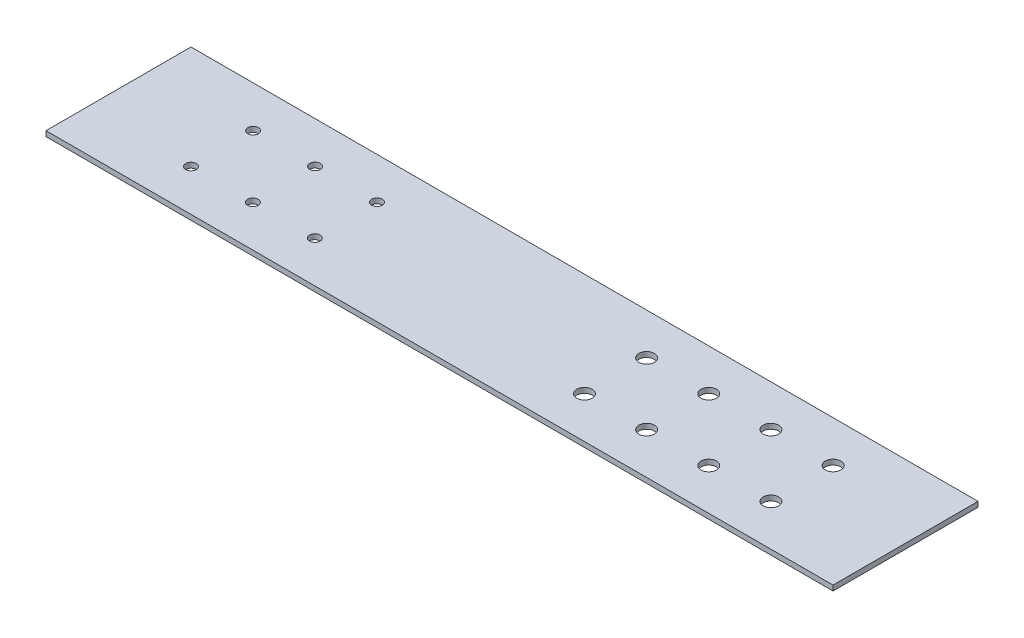
ISO-10303-21;
HEADER;
FILE_DESCRIPTION(('STEP AP214'),'2;1');
FILE_NAME('part.step','',(''),(''),'','','');
FILE_SCHEMA(('AUTOMOTIVE_DESIGN { 1 0 10303 214 1 1 1 1 }'));
ENDSEC;
DATA;
#1=APPLICATION_CONTEXT('core data for automotive mechanical design processes');
#2=APPLICATION_PROTOCOL_DEFINITION('international standard','automotive_design',2000,#1);
#3=PRODUCT_CONTEXT('',#1,'mechanical');
#4=PRODUCT('Part','Part','',(#3));
#5=PRODUCT_RELATED_PRODUCT_CATEGORY('part','',(#4));
#6=PRODUCT_DEFINITION_FORMATION('','',#4);
#7=PRODUCT_DEFINITION_CONTEXT('part definition',#1,'design');
#8=PRODUCT_DEFINITION('design','',#6,#7);
#9=PRODUCT_DEFINITION_SHAPE('','',#8);
#10=(LENGTH_UNIT() NAMED_UNIT(*) SI_UNIT(.MILLI.,.METRE.));
#11=(NAMED_UNIT(*) PLANE_ANGLE_UNIT() SI_UNIT($,.RADIAN.));
#12=(NAMED_UNIT(*) SI_UNIT($,.STERADIAN.) SOLID_ANGLE_UNIT());
#13=UNCERTAINTY_MEASURE_WITH_UNIT(LENGTH_MEASURE(1.E-05),#10,'distance_accuracy_value','');
#14=(GEOMETRIC_REPRESENTATION_CONTEXT(3) GLOBAL_UNCERTAINTY_ASSIGNED_CONTEXT((#13)) GLOBAL_UNIT_ASSIGNED_CONTEXT((#10,
#11,#12)) REPRESENTATION_CONTEXT('',''));
#15=CARTESIAN_POINT('',(0.,0.,0.));
#16=DIRECTION('',(0.,0.,1.));
#17=DIRECTION('',(1.,0.,0.));
#18=AXIS2_PLACEMENT_3D('',#15,#16,#17);
#19=CARTESIAN_POINT('',(-241.3,3.175,-44.45));
#20=DIRECTION('',(1.,0.,0.));
#21=DIRECTION('',(0.,0.,-1.));
#22=AXIS2_PLACEMENT_3D('',#19,#20,#21);
#23=PLANE('',#22);
#24=DIRECTION('',(0.,0.,1.));
#25=VECTOR('',#24,1.);
#26=CARTESIAN_POINT('',(-241.3,0.,-44.45));
#27=LINE('',#26,#25);
#28=CARTESIAN_POINT('',(-241.3,0.,-44.45));
#29=VERTEX_POINT('',#28);
#30=CARTESIAN_POINT('',(-241.3,0.,44.45));
#31=VERTEX_POINT('',#30);
#32=EDGE_CURVE('E107',#29,#31,#27,.T.);
#33=ORIENTED_EDGE('',*,*,#32,.T.);
#34=DIRECTION('',(0.,-1.,0.));
#35=VECTOR('',#34,1.);
#36=CARTESIAN_POINT('',(-241.3,3.175,44.45));
#37=LINE('',#36,#35);
#38=CARTESIAN_POINT('',(-241.3,3.175,44.45));
#39=VERTEX_POINT('',#38);
#40=EDGE_CURVE('E11',#39,#31,#37,.T.);
#41=ORIENTED_EDGE('',*,*,#40,.F.);
#42=DIRECTION('',(0.,0.,1.));
#43=VECTOR('',#42,1.);
#44=CARTESIAN_POINT('',(-241.3,3.175,-44.45));
#45=LINE('',#44,#43);
#46=CARTESIAN_POINT('',(-241.3,3.175,-44.45));
#47=VERTEX_POINT('',#46);
#48=EDGE_CURVE('E91',#47,#39,#45,.T.);
#49=ORIENTED_EDGE('',*,*,#48,.F.);
#50=DIRECTION('',(0.,-1.,0.));
#51=VECTOR('',#50,1.);
#52=CARTESIAN_POINT('',(-241.3,3.175,-44.45));
#53=LINE('',#52,#51);
#54=EDGE_CURVE('E103',#47,#29,#53,.T.);
#55=ORIENTED_EDGE('',*,*,#54,.T.);
#56=EDGE_LOOP('',(#33,#41,#49,#55));
#57=FACE_BOUND('',#56,.T.);
#58=ADVANCED_FACE('F39',(#57),#23,.F.);
#59=CARTESIAN_POINT('',(241.3,3.175,44.45));
#60=DIRECTION('',(0.,0.,-1.));
#61=DIRECTION('',(-1.,0.,0.));
#62=AXIS2_PLACEMENT_3D('',#59,#60,#61);
#63=PLANE('',#62);
#64=DIRECTION('',(1.,0.,0.));
#65=VECTOR('',#64,1.);
#66=CARTESIAN_POINT('',(241.3,0.,44.45));
#67=LINE('',#66,#65);
#68=CARTESIAN_POINT('',(241.3,0.,44.45));
#69=VERTEX_POINT('',#68);
#70=EDGE_CURVE('E96',#31,#69,#67,.T.);
#71=ORIENTED_EDGE('',*,*,#70,.T.);
#72=DIRECTION('',(0.,-1.,0.));
#73=VECTOR('',#72,1.);
#74=CARTESIAN_POINT('',(241.3,3.175,44.45));
#75=LINE('',#74,#73);
#76=CARTESIAN_POINT('',(241.3,3.175,44.45));
#77=VERTEX_POINT('',#76);
#78=EDGE_CURVE('E48',#77,#69,#75,.T.);
#79=ORIENTED_EDGE('',*,*,#78,.F.);
#80=DIRECTION('',(1.,0.,0.));
#81=VECTOR('',#80,1.);
#82=CARTESIAN_POINT('',(241.3,3.175,44.45));
#83=LINE('',#82,#81);
#84=EDGE_CURVE('E86',#39,#77,#83,.T.);
#85=ORIENTED_EDGE('',*,*,#84,.F.);
#86=ORIENTED_EDGE('',*,*,#40,.T.);
#87=EDGE_LOOP('',(#71,#79,#85,#86));
#88=FACE_BOUND('',#87,.T.);
#89=ADVANCED_FACE('F95',(#88),#63,.F.);
#90=CARTESIAN_POINT('',(241.3,3.175,-44.45));
#91=DIRECTION('',(-1.,0.,0.));
#92=DIRECTION('',(0.,0.,1.));
#93=AXIS2_PLACEMENT_3D('',#90,#91,#92);
#94=PLANE('',#93);
#95=DIRECTION('',(0.,0.,-1.));
#96=VECTOR('',#95,1.);
#97=CARTESIAN_POINT('',(241.3,0.,-44.45));
#98=LINE('',#97,#96);
#99=CARTESIAN_POINT('',(241.3,0.,-44.45));
#100=VERTEX_POINT('',#99);
#101=EDGE_CURVE('E73',#69,#100,#98,.T.);
#102=ORIENTED_EDGE('',*,*,#101,.T.);
#103=DIRECTION('',(0.,-1.,0.));
#104=VECTOR('',#103,1.);
#105=CARTESIAN_POINT('',(241.3,3.175,-44.45));
#106=LINE('',#105,#104);
#107=CARTESIAN_POINT('',(241.3,3.175,-44.45));
#108=VERTEX_POINT('',#107);
#109=EDGE_CURVE('E98',#108,#100,#106,.T.);
#110=ORIENTED_EDGE('',*,*,#109,.F.);
#111=DIRECTION('',(0.,0.,-1.));
#112=VECTOR('',#111,1.);
#113=CARTESIAN_POINT('',(241.3,3.175,-44.45));
#114=LINE('',#113,#112);
#115=EDGE_CURVE('E89',#77,#108,#114,.T.);
#116=ORIENTED_EDGE('',*,*,#115,.F.);
#117=ORIENTED_EDGE('',*,*,#78,.T.);
#118=EDGE_LOOP('',(#102,#110,#116,#117));
#119=FACE_BOUND('',#118,.T.);
#120=ADVANCED_FACE('F99',(#119),#94,.F.);
#121=CARTESIAN_POINT('',(241.3,3.175,-44.45));
#122=DIRECTION('',(0.,0.,1.));
#123=DIRECTION('',(1.,0.,0.));
#124=AXIS2_PLACEMENT_3D('',#121,#122,#123);
#125=PLANE('',#124);
#126=DIRECTION('',(-1.,0.,0.));
#127=VECTOR('',#126,1.);
#128=CARTESIAN_POINT('',(241.3,0.,-44.45));
#129=LINE('',#128,#127);
#130=EDGE_CURVE('E79',#100,#29,#129,.T.);
#131=ORIENTED_EDGE('',*,*,#130,.T.);
#132=ORIENTED_EDGE('',*,*,#54,.F.);
#133=DIRECTION('',(-1.,0.,0.));
#134=VECTOR('',#133,1.);
#135=CARTESIAN_POINT('',(241.3,3.175,-44.45));
#136=LINE('',#135,#134);
#137=EDGE_CURVE('E56',#108,#47,#136,.T.);
#138=ORIENTED_EDGE('',*,*,#137,.F.);
#139=ORIENTED_EDGE('',*,*,#109,.T.);
#140=EDGE_LOOP('',(#131,#132,#138,#139));
#141=FACE_BOUND('',#140,.T.);
#142=ADVANCED_FACE('F121',(#141),#125,.F.);
#143=CARTESIAN_POINT('',(0.,3.175,0.));
#144=DIRECTION('',(0.,-1.,0.));
#145=DIRECTION('',(0.,0.,-1.));
#146=AXIS2_PLACEMENT_3D('',#143,#144,#145);
#147=PLANE('',#146);
#148=CARTESIAN_POINT('',(-139.821484560945,3.175,19.0500000000015));
#149=DIRECTION('',(0.,1.,0.));
#150=DIRECTION('',(0.,0.,1.));
#151=AXIS2_PLACEMENT_3D('',#148,#149,#150);
#152=CIRCLE('',#151,3.25000000000001);
#153=CARTESIAN_POINT('',(-139.821484560945,3.175,22.3000000000015));
#154=VERTEX_POINT('',#153);
#155=EDGE_CURVE('E193',#154,#154,#152,.T.);
#156=ORIENTED_EDGE('',*,*,#155,.F.);
#157=EDGE_LOOP('',(#156));
#158=FACE_BOUND('',#157,.T.);
#159=CARTESIAN_POINT('',(-177.8,3.175,19.0500000000017));
#160=DIRECTION('',(0.,1.,0.));
#161=DIRECTION('',(0.,0.,1.));
#162=AXIS2_PLACEMENT_3D('',#159,#160,#161);
#163=CIRCLE('',#162,3.25000000000001);
#164=CARTESIAN_POINT('',(-177.8,3.175,22.3000000000017));
#165=VERTEX_POINT('',#164);
#166=EDGE_CURVE('E185',#165,#165,#163,.T.);
#167=ORIENTED_EDGE('',*,*,#166,.F.);
#168=EDGE_LOOP('',(#167));
#169=FACE_BOUND('',#168,.T.);
#170=CARTESIAN_POINT('',(-139.821484560945,3.175,-19.0499999999972));
#171=DIRECTION('',(0.,1.,0.));
#172=DIRECTION('',(0.,0.,1.));
#173=AXIS2_PLACEMENT_3D('',#170,#171,#172);
#174=CIRCLE('',#173,3.25000000000001);
#175=CARTESIAN_POINT('',(-139.821484560945,3.175,-15.7999999999972));
#176=VERTEX_POINT('',#175);
#177=EDGE_CURVE('E177',#176,#176,#174,.T.);
#178=ORIENTED_EDGE('',*,*,#177,.F.);
#179=EDGE_LOOP('',(#178));
#180=FACE_BOUND('',#179,.T.);
#181=CARTESIAN_POINT('',(-177.8,3.175,-19.0499999999972));
#182=DIRECTION('',(0.,1.,0.));
#183=DIRECTION('',(0.,0.,1.));
#184=AXIS2_PLACEMENT_3D('',#181,#182,#183);
#185=CIRCLE('',#184,3.25000000000001);
#186=CARTESIAN_POINT('',(-177.8,3.175,-15.7999999999972));
#187=VERTEX_POINT('',#186);
#188=EDGE_CURVE('E153',#187,#187,#185,.T.);
#189=ORIENTED_EDGE('',*,*,#188,.F.);
#190=EDGE_LOOP('',(#189));
#191=FACE_BOUND('',#190,.T.);
#192=CARTESIAN_POINT('',(101.600000000001,3.175,19.0500000000025));
#193=DIRECTION('',(0.,1.,0.));
#194=DIRECTION('',(0.,0.,1.));
#195=AXIS2_PLACEMENT_3D('',#192,#193,#194);
#196=CIRCLE('',#195,4.7625);
#197=CARTESIAN_POINT('',(101.600000000001,3.175,23.8125000000025));
#198=VERTEX_POINT('',#197);
#199=EDGE_CURVE('E154',#198,#198,#196,.T.);
#200=ORIENTED_EDGE('',*,*,#199,.F.);
#201=EDGE_LOOP('',(#200));
#202=FACE_BOUND('',#201,.T.);
#203=CARTESIAN_POINT('',(139.700000000001,3.175,19.0500000000023));
#204=DIRECTION('',(0.,1.,0.));
#205=DIRECTION('',(0.,0.,1.));
#206=AXIS2_PLACEMENT_3D('',#203,#204,#205);
#207=CIRCLE('',#206,4.76250000000001);
#208=CARTESIAN_POINT('',(139.700000000001,3.175,23.8125000000023));
#209=VERTEX_POINT('',#208);
#210=EDGE_CURVE('E163',#209,#209,#207,.T.);
#211=ORIENTED_EDGE('',*,*,#210,.F.);
#212=EDGE_LOOP('',(#211));
#213=FACE_BOUND('',#212,.T.);
#214=CARTESIAN_POINT('',(177.800000000001,3.175,19.050000000002));
#215=DIRECTION('',(0.,1.,0.));
#216=DIRECTION('',(0.,0.,1.));
#217=AXIS2_PLACEMENT_3D('',#214,#215,#216);
#218=CIRCLE('',#217,4.76250000000001);
#219=CARTESIAN_POINT('',(177.800000000001,3.175,23.812500000002));
#220=VERTEX_POINT('',#219);
#221=EDGE_CURVE('E136',#220,#220,#218,.T.);
#222=ORIENTED_EDGE('',*,*,#221,.F.);
#223=EDGE_LOOP('',(#222));
#224=FACE_BOUND('',#223,.T.);
#225=CARTESIAN_POINT('',(-101.842969121891,3.175,-19.0499999999972));
#226=DIRECTION('',(0.,1.,0.));
#227=DIRECTION('',(0.,0.,1.));
#228=AXIS2_PLACEMENT_3D('',#225,#226,#227);
#229=CIRCLE('',#228,3.25000000000001);
#230=CARTESIAN_POINT('',(-101.842969121891,3.175,-15.7999999999972));
#231=VERTEX_POINT('',#230);
#232=EDGE_CURVE('E145',#231,#231,#229,.T.);
#233=ORIENTED_EDGE('',*,*,#232,.F.);
#234=EDGE_LOOP('',(#233));
#235=FACE_BOUND('',#234,.T.);
#236=CARTESIAN_POINT('',(63.5000000000001,3.175,-19.0499999999972));
#237=DIRECTION('',(0.,1.,0.));
#238=DIRECTION('',(0.,0.,1.));
#239=AXIS2_PLACEMENT_3D('',#236,#237,#238);
#240=CIRCLE('',#239,4.7625);
#241=CARTESIAN_POINT('',(63.5000000000001,3.175,-14.2874999999972));
#242=VERTEX_POINT('',#241);
#243=EDGE_CURVE('E208',#242,#242,#240,.T.);
#244=ORIENTED_EDGE('',*,*,#243,.F.);
#245=EDGE_LOOP('',(#244));
#246=FACE_BOUND('',#245,.T.);
#247=CARTESIAN_POINT('',(101.6,3.175,-19.0499999999975));
#248=DIRECTION('',(0.,1.,0.));
#249=DIRECTION('',(0.,0.,1.));
#250=AXIS2_PLACEMENT_3D('',#247,#248,#249);
#251=CIRCLE('',#250,4.7625);
#252=CARTESIAN_POINT('',(101.6,3.175,-14.2874999999975));
#253=VERTEX_POINT('',#252);
#254=EDGE_CURVE('E232',#253,#253,#251,.T.);
#255=ORIENTED_EDGE('',*,*,#254,.F.);
#256=EDGE_LOOP('',(#255));
#257=FACE_BOUND('',#256,.T.);
#258=CARTESIAN_POINT('',(139.7,3.175,-19.0499999999977));
#259=DIRECTION('',(0.,1.,0.));
#260=DIRECTION('',(0.,0.,1.));
#261=AXIS2_PLACEMENT_3D('',#258,#259,#260);
#262=CIRCLE('',#261,4.76250000000001);
#263=CARTESIAN_POINT('',(139.7,3.175,-14.2874999999977));
#264=VERTEX_POINT('',#263);
#265=EDGE_CURVE('E209',#264,#264,#262,.T.);
#266=ORIENTED_EDGE('',*,*,#265,.F.);
#267=EDGE_LOOP('',(#266));
#268=FACE_BOUND('',#267,.T.);
#269=CARTESIAN_POINT('',(63.5000000000007,3.175,19.0500000000028));
#270=DIRECTION('',(0.,1.,0.));
#271=DIRECTION('',(0.,0.,1.));
#272=AXIS2_PLACEMENT_3D('',#269,#270,#271);
#273=CIRCLE('',#272,4.7625);
#274=CARTESIAN_POINT('',(63.5000000000007,3.175,23.8125000000028));
#275=VERTEX_POINT('',#274);
#276=EDGE_CURVE('E218',#275,#275,#273,.T.);
#277=ORIENTED_EDGE('',*,*,#276,.F.);
#278=EDGE_LOOP('',(#277));
#279=FACE_BOUND('',#278,.T.);
#280=CARTESIAN_POINT('',(177.8,3.175,-19.049999999998));
#281=DIRECTION('',(0.,1.,0.));
#282=DIRECTION('',(0.,0.,1.));
#283=AXIS2_PLACEMENT_3D('',#280,#281,#282);
#284=CIRCLE('',#283,4.76250000000001);
#285=CARTESIAN_POINT('',(177.8,3.175,-14.287499999998));
#286=VERTEX_POINT('',#285);
#287=EDGE_CURVE('E200',#286,#286,#284,.T.);
#288=ORIENTED_EDGE('',*,*,#287,.F.);
#289=EDGE_LOOP('',(#288));
#290=FACE_BOUND('',#289,.T.);
#291=CARTESIAN_POINT('',(-101.842969121891,3.175,19.0500000000012));
#292=DIRECTION('',(0.,1.,0.));
#293=DIRECTION('',(0.,0.,1.));
#294=AXIS2_PLACEMENT_3D('',#291,#292,#293);
#295=CIRCLE('',#294,3.25000000000001);
#296=CARTESIAN_POINT('',(-101.842969121891,3.175,22.3000000000012));
#297=VERTEX_POINT('',#296);
#298=EDGE_CURVE('E128',#297,#297,#295,.T.);
#299=ORIENTED_EDGE('',*,*,#298,.F.);
#300=EDGE_LOOP('',(#299));
#301=FACE_BOUND('',#300,.T.);
#302=ORIENTED_EDGE('',*,*,#48,.T.);
#303=ORIENTED_EDGE('',*,*,#84,.T.);
#304=ORIENTED_EDGE('',*,*,#115,.T.);
#305=ORIENTED_EDGE('',*,*,#137,.T.);
#306=EDGE_LOOP('',(#302,#303,#304,#305));
#307=FACE_BOUND('',#306,.T.);
#308=ADVANCED_FACE('F87',(#158,#169,#180,#191,#202,#213,#224,#235,#246,#257,#268,#279,#290,#301,
#307),#147,.F.);
#309=CARTESIAN_POINT('',(0.,0.,0.));
#310=DIRECTION('',(0.,-1.,0.));
#311=DIRECTION('',(0.,0.,-1.));
#312=AXIS2_PLACEMENT_3D('',#309,#310,#311);
#313=PLANE('',#312);
#314=CARTESIAN_POINT('',(-139.821484560945,0.,19.0500000000015));
#315=DIRECTION('',(0.,1.,0.));
#316=DIRECTION('',(0.,0.,1.));
#317=AXIS2_PLACEMENT_3D('',#314,#315,#316);
#318=CIRCLE('',#317,3.25000000000001);
#319=CARTESIAN_POINT('',(-139.821484560945,0.,22.3000000000015));
#320=VERTEX_POINT('',#319);
#321=EDGE_CURVE('E132',#320,#320,#318,.T.);
#322=ORIENTED_EDGE('',*,*,#321,.T.);
#323=EDGE_LOOP('',(#322));
#324=FACE_BOUND('',#323,.T.);
#325=CARTESIAN_POINT('',(-177.8,0.,19.0500000000017));
#326=DIRECTION('',(0.,1.,0.));
#327=DIRECTION('',(0.,0.,1.));
#328=AXIS2_PLACEMENT_3D('',#325,#326,#327);
#329=CIRCLE('',#328,3.25000000000001);
#330=CARTESIAN_POINT('',(-177.8,0.,22.3000000000017));
#331=VERTEX_POINT('',#330);
#332=EDGE_CURVE('E189',#331,#331,#329,.T.);
#333=ORIENTED_EDGE('',*,*,#332,.T.);
#334=EDGE_LOOP('',(#333));
#335=FACE_BOUND('',#334,.T.);
#336=CARTESIAN_POINT('',(-139.821484560945,0.,-19.0499999999972));
#337=DIRECTION('',(0.,1.,0.));
#338=DIRECTION('',(0.,0.,1.));
#339=AXIS2_PLACEMENT_3D('',#336,#337,#338);
#340=CIRCLE('',#339,3.25000000000001);
#341=CARTESIAN_POINT('',(-139.821484560945,0.,-15.7999999999972));
#342=VERTEX_POINT('',#341);
#343=EDGE_CURVE('E181',#342,#342,#340,.T.);
#344=ORIENTED_EDGE('',*,*,#343,.T.);
#345=EDGE_LOOP('',(#344));
#346=FACE_BOUND('',#345,.T.);
#347=CARTESIAN_POINT('',(-177.8,0.,-19.0499999999972));
#348=DIRECTION('',(0.,1.,0.));
#349=DIRECTION('',(0.,0.,1.));
#350=AXIS2_PLACEMENT_3D('',#347,#348,#349);
#351=CIRCLE('',#350,3.25000000000001);
#352=CARTESIAN_POINT('',(-177.8,0.,-15.7999999999972));
#353=VERTEX_POINT('',#352);
#354=EDGE_CURVE('E173',#353,#353,#351,.T.);
#355=ORIENTED_EDGE('',*,*,#354,.T.);
#356=EDGE_LOOP('',(#355));
#357=FACE_BOUND('',#356,.T.);
#358=CARTESIAN_POINT('',(101.600000000001,0.,19.0500000000025));
#359=DIRECTION('',(0.,1.,0.));
#360=DIRECTION('',(0.,0.,1.));
#361=AXIS2_PLACEMENT_3D('',#358,#359,#360);
#362=CIRCLE('',#361,4.7625);
#363=CARTESIAN_POINT('',(101.600000000001,0.,23.8125000000025));
#364=VERTEX_POINT('',#363);
#365=EDGE_CURVE('E158',#364,#364,#362,.T.);
#366=ORIENTED_EDGE('',*,*,#365,.T.);
#367=EDGE_LOOP('',(#366));
#368=FACE_BOUND('',#367,.T.);
#369=CARTESIAN_POINT('',(139.700000000001,0.,19.0500000000023));
#370=DIRECTION('',(0.,1.,0.));
#371=DIRECTION('',(0.,0.,1.));
#372=AXIS2_PLACEMENT_3D('',#369,#370,#371);
#373=CIRCLE('',#372,4.76250000000001);
#374=CARTESIAN_POINT('',(139.700000000001,0.,23.8125000000023));
#375=VERTEX_POINT('',#374);
#376=EDGE_CURVE('E141',#375,#375,#373,.T.);
#377=ORIENTED_EDGE('',*,*,#376,.T.);
#378=EDGE_LOOP('',(#377));
#379=FACE_BOUND('',#378,.T.);
#380=CARTESIAN_POINT('',(177.800000000001,0.,19.050000000002));
#381=DIRECTION('',(0.,1.,0.));
#382=DIRECTION('',(0.,0.,1.));
#383=AXIS2_PLACEMENT_3D('',#380,#381,#382);
#384=CIRCLE('',#383,4.76250000000001);
#385=CARTESIAN_POINT('',(177.800000000001,0.,23.812500000002));
#386=VERTEX_POINT('',#385);
#387=EDGE_CURVE('E140',#386,#386,#384,.T.);
#388=ORIENTED_EDGE('',*,*,#387,.T.);
#389=EDGE_LOOP('',(#388));
#390=FACE_BOUND('',#389,.T.);
#391=CARTESIAN_POINT('',(-101.842969121891,0.,-19.0499999999972));
#392=DIRECTION('',(0.,1.,0.));
#393=DIRECTION('',(0.,0.,1.));
#394=AXIS2_PLACEMENT_3D('',#391,#392,#393);
#395=CIRCLE('',#394,3.25000000000001);
#396=CARTESIAN_POINT('',(-101.842969121891,0.,-15.7999999999972));
#397=VERTEX_POINT('',#396);
#398=EDGE_CURVE('E149',#397,#397,#395,.T.);
#399=ORIENTED_EDGE('',*,*,#398,.T.);
#400=EDGE_LOOP('',(#399));
#401=FACE_BOUND('',#400,.T.);
#402=CARTESIAN_POINT('',(63.5000000000001,0.,-19.0499999999972));
#403=DIRECTION('',(0.,1.,0.));
#404=DIRECTION('',(0.,0.,1.));
#405=AXIS2_PLACEMENT_3D('',#402,#403,#404);
#406=CIRCLE('',#405,4.7625);
#407=CARTESIAN_POINT('',(63.5000000000001,0.,-14.2874999999972));
#408=VERTEX_POINT('',#407);
#409=EDGE_CURVE('E228',#408,#408,#406,.T.);
#410=ORIENTED_EDGE('',*,*,#409,.T.);
#411=EDGE_LOOP('',(#410));
#412=FACE_BOUND('',#411,.T.);
#413=CARTESIAN_POINT('',(101.6,0.,-19.0499999999975));
#414=DIRECTION('',(0.,1.,0.));
#415=DIRECTION('',(0.,0.,1.));
#416=AXIS2_PLACEMENT_3D('',#413,#414,#415);
#417=CIRCLE('',#416,4.7625);
#418=CARTESIAN_POINT('',(101.6,0.,-14.2874999999975));
#419=VERTEX_POINT('',#418);
#420=EDGE_CURVE('E214',#419,#419,#417,.T.);
#421=ORIENTED_EDGE('',*,*,#420,.T.);
#422=EDGE_LOOP('',(#421));
#423=FACE_BOUND('',#422,.T.);
#424=CARTESIAN_POINT('',(139.7,0.,-19.0499999999977));
#425=DIRECTION('',(0.,1.,0.));
#426=DIRECTION('',(0.,0.,1.));
#427=AXIS2_PLACEMENT_3D('',#424,#425,#426);
#428=CIRCLE('',#427,4.76250000000001);
#429=CARTESIAN_POINT('',(139.7,0.,-14.2874999999977));
#430=VERTEX_POINT('',#429);
#431=EDGE_CURVE('E213',#430,#430,#428,.T.);
#432=ORIENTED_EDGE('',*,*,#431,.T.);
#433=EDGE_LOOP('',(#432));
#434=FACE_BOUND('',#433,.T.);
#435=CARTESIAN_POINT('',(63.5000000000007,0.,19.0500000000028));
#436=DIRECTION('',(0.,1.,0.));
#437=DIRECTION('',(0.,0.,1.));
#438=AXIS2_PLACEMENT_3D('',#435,#436,#437);
#439=CIRCLE('',#438,4.7625);
#440=CARTESIAN_POINT('',(63.5000000000007,0.,23.8125000000028));
#441=VERTEX_POINT('',#440);
#442=EDGE_CURVE('E159',#441,#441,#439,.T.);
#443=ORIENTED_EDGE('',*,*,#442,.T.);
#444=EDGE_LOOP('',(#443));
#445=FACE_BOUND('',#444,.T.);
#446=CARTESIAN_POINT('',(177.8,0.,-19.049999999998));
#447=DIRECTION('',(0.,1.,0.));
#448=DIRECTION('',(0.,0.,1.));
#449=AXIS2_PLACEMENT_3D('',#446,#447,#448);
#450=CIRCLE('',#449,4.76250000000001);
#451=CARTESIAN_POINT('',(177.8,0.,-14.287499999998));
#452=VERTEX_POINT('',#451);
#453=EDGE_CURVE('E204',#452,#452,#450,.T.);
#454=ORIENTED_EDGE('',*,*,#453,.T.);
#455=EDGE_LOOP('',(#454));
#456=FACE_BOUND('',#455,.T.);
#457=CARTESIAN_POINT('',(-101.842969121891,0.,19.0500000000012));
#458=DIRECTION('',(0.,1.,0.));
#459=DIRECTION('',(0.,0.,1.));
#460=AXIS2_PLACEMENT_3D('',#457,#458,#459);
#461=CIRCLE('',#460,3.25000000000001);
#462=CARTESIAN_POINT('',(-101.842969121891,0.,22.3000000000012));
#463=VERTEX_POINT('',#462);
#464=EDGE_CURVE('E111',#463,#463,#461,.T.);
#465=ORIENTED_EDGE('',*,*,#464,.T.);
#466=EDGE_LOOP('',(#465));
#467=FACE_BOUND('',#466,.T.);
#468=ORIENTED_EDGE('',*,*,#32,.F.);
#469=ORIENTED_EDGE('',*,*,#130,.F.);
#470=ORIENTED_EDGE('',*,*,#101,.F.);
#471=ORIENTED_EDGE('',*,*,#70,.F.);
#472=EDGE_LOOP('',(#468,#469,#470,#471));
#473=FACE_BOUND('',#472,.T.);
#474=ADVANCED_FACE('F124',(#324,#335,#346,#357,#368,#379,#390,#401,#412,#423,#434,#445,#456,
#467,#473),#313,.T.);
#475=CARTESIAN_POINT('',(-101.842969121891,0.,19.0500000000012));
#476=DIRECTION('',(0.,1.,0.));
#477=DIRECTION('',(0.,0.,1.));
#478=AXIS2_PLACEMENT_3D('',#475,#476,#477);
#479=CYLINDRICAL_SURFACE('',#478,3.25000000000001);
#480=ORIENTED_EDGE('',*,*,#464,.F.);
#481=EDGE_LOOP('',(#480));
#482=FACE_BOUND('',#481,.T.);
#483=ORIENTED_EDGE('',*,*,#298,.T.);
#484=EDGE_LOOP('',(#483));
#485=FACE_BOUND('',#484,.T.);
#486=ADVANCED_FACE('F262',(#482,#485),#479,.F.);
#487=CARTESIAN_POINT('',(177.8,0.,-19.049999999998));
#488=DIRECTION('',(0.,1.,0.));
#489=DIRECTION('',(0.,0.,1.));
#490=AXIS2_PLACEMENT_3D('',#487,#488,#489);
#491=CYLINDRICAL_SURFACE('',#490,4.76250000000001);
#492=ORIENTED_EDGE('',*,*,#453,.F.);
#493=EDGE_LOOP('',(#492));
#494=FACE_BOUND('',#493,.T.);
#495=ORIENTED_EDGE('',*,*,#287,.T.);
#496=EDGE_LOOP('',(#495));
#497=FACE_BOUND('',#496,.T.);
#498=ADVANCED_FACE('F264',(#494,#497),#491,.F.);
#499=CARTESIAN_POINT('',(63.5000000000007,0.,19.0500000000028));
#500=DIRECTION('',(0.,1.,0.));
#501=DIRECTION('',(0.,0.,1.));
#502=AXIS2_PLACEMENT_3D('',#499,#500,#501);
#503=CYLINDRICAL_SURFACE('',#502,4.7625);
#504=ORIENTED_EDGE('',*,*,#442,.F.);
#505=EDGE_LOOP('',(#504));
#506=FACE_BOUND('',#505,.T.);
#507=ORIENTED_EDGE('',*,*,#276,.T.);
#508=EDGE_LOOP('',(#507));
#509=FACE_BOUND('',#508,.T.);
#510=ADVANCED_FACE('F271',(#506,#509),#503,.F.);
#511=CARTESIAN_POINT('',(139.7,0.,-19.0499999999977));
#512=DIRECTION('',(0.,1.,0.));
#513=DIRECTION('',(0.,0.,1.));
#514=AXIS2_PLACEMENT_3D('',#511,#512,#513);
#515=CYLINDRICAL_SURFACE('',#514,4.76250000000001);
#516=ORIENTED_EDGE('',*,*,#431,.F.);
#517=EDGE_LOOP('',(#516));
#518=FACE_BOUND('',#517,.T.);
#519=ORIENTED_EDGE('',*,*,#265,.T.);
#520=EDGE_LOOP('',(#519));
#521=FACE_BOUND('',#520,.T.);
#522=ADVANCED_FACE('F246',(#518,#521),#515,.F.);
#523=CARTESIAN_POINT('',(101.6,0.,-19.0499999999975));
#524=DIRECTION('',(0.,1.,0.));
#525=DIRECTION('',(0.,0.,1.));
#526=AXIS2_PLACEMENT_3D('',#523,#524,#525);
#527=CYLINDRICAL_SURFACE('',#526,4.7625);
#528=ORIENTED_EDGE('',*,*,#420,.F.);
#529=EDGE_LOOP('',(#528));
#530=FACE_BOUND('',#529,.T.);
#531=ORIENTED_EDGE('',*,*,#254,.T.);
#532=EDGE_LOOP('',(#531));
#533=FACE_BOUND('',#532,.T.);
#534=ADVANCED_FACE('F242',(#530,#533),#527,.F.);
#535=CARTESIAN_POINT('',(63.5000000000001,0.,-19.0499999999972));
#536=DIRECTION('',(0.,1.,0.));
#537=DIRECTION('',(0.,0.,1.));
#538=AXIS2_PLACEMENT_3D('',#535,#536,#537);
#539=CYLINDRICAL_SURFACE('',#538,4.7625);
#540=ORIENTED_EDGE('',*,*,#409,.F.);
#541=EDGE_LOOP('',(#540));
#542=FACE_BOUND('',#541,.T.);
#543=ORIENTED_EDGE('',*,*,#243,.T.);
#544=EDGE_LOOP('',(#543));
#545=FACE_BOUND('',#544,.T.);
#546=ADVANCED_FACE('F245',(#542,#545),#539,.F.);
#547=CARTESIAN_POINT('',(-101.842969121891,0.,-19.0499999999972));
#548=DIRECTION('',(0.,1.,0.));
#549=DIRECTION('',(0.,0.,1.));
#550=AXIS2_PLACEMENT_3D('',#547,#548,#549);
#551=CYLINDRICAL_SURFACE('',#550,3.25000000000001);
#552=ORIENTED_EDGE('',*,*,#398,.F.);
#553=EDGE_LOOP('',(#552));
#554=FACE_BOUND('',#553,.T.);
#555=ORIENTED_EDGE('',*,*,#232,.T.);
#556=EDGE_LOOP('',(#555));
#557=FACE_BOUND('',#556,.T.);
#558=ADVANCED_FACE('F343',(#554,#557),#551,.F.);
#559=CARTESIAN_POINT('',(177.800000000001,0.,19.050000000002));
#560=DIRECTION('',(0.,1.,0.));
#561=DIRECTION('',(0.,0.,1.));
#562=AXIS2_PLACEMENT_3D('',#559,#560,#561);
#563=CYLINDRICAL_SURFACE('',#562,4.76250000000001);
#564=ORIENTED_EDGE('',*,*,#387,.F.);
#565=EDGE_LOOP('',(#564));
#566=FACE_BOUND('',#565,.T.);
#567=ORIENTED_EDGE('',*,*,#221,.T.);
#568=EDGE_LOOP('',(#567));
#569=FACE_BOUND('',#568,.T.);
#570=ADVANCED_FACE('F353',(#566,#569),#563,.F.);
#571=CARTESIAN_POINT('',(139.700000000001,0.,19.0500000000023));
#572=DIRECTION('',(0.,1.,0.));
#573=DIRECTION('',(0.,0.,1.));
#574=AXIS2_PLACEMENT_3D('',#571,#572,#573);
#575=CYLINDRICAL_SURFACE('',#574,4.76250000000001);
#576=ORIENTED_EDGE('',*,*,#376,.F.);
#577=EDGE_LOOP('',(#576));
#578=FACE_BOUND('',#577,.T.);
#579=ORIENTED_EDGE('',*,*,#210,.T.);
#580=EDGE_LOOP('',(#579));
#581=FACE_BOUND('',#580,.T.);
#582=ADVANCED_FACE('F363',(#578,#581),#575,.F.);
#583=CARTESIAN_POINT('',(101.600000000001,0.,19.0500000000025));
#584=DIRECTION('',(0.,1.,0.));
#585=DIRECTION('',(0.,0.,1.));
#586=AXIS2_PLACEMENT_3D('',#583,#584,#585);
#587=CYLINDRICAL_SURFACE('',#586,4.7625);
#588=ORIENTED_EDGE('',*,*,#365,.F.);
#589=EDGE_LOOP('',(#588));
#590=FACE_BOUND('',#589,.T.);
#591=ORIENTED_EDGE('',*,*,#199,.T.);
#592=EDGE_LOOP('',(#591));
#593=FACE_BOUND('',#592,.T.);
#594=ADVANCED_FACE('F372',(#590,#593),#587,.F.);
#595=CARTESIAN_POINT('',(-177.8,0.,-19.0499999999972));
#596=DIRECTION('',(0.,1.,0.));
#597=DIRECTION('',(0.,0.,1.));
#598=AXIS2_PLACEMENT_3D('',#595,#596,#597);
#599=CYLINDRICAL_SURFACE('',#598,3.25000000000001);
#600=ORIENTED_EDGE('',*,*,#354,.F.);
#601=EDGE_LOOP('',(#600));
#602=FACE_BOUND('',#601,.T.);
#603=ORIENTED_EDGE('',*,*,#188,.T.);
#604=EDGE_LOOP('',(#603));
#605=FACE_BOUND('',#604,.T.);
#606=ADVANCED_FACE('F382',(#602,#605),#599,.F.);
#607=CARTESIAN_POINT('',(-139.821484560945,0.,-19.0499999999972));
#608=DIRECTION('',(0.,1.,0.));
#609=DIRECTION('',(0.,0.,1.));
#610=AXIS2_PLACEMENT_3D('',#607,#608,#609);
#611=CYLINDRICAL_SURFACE('',#610,3.25000000000001);
#612=ORIENTED_EDGE('',*,*,#343,.F.);
#613=EDGE_LOOP('',(#612));
#614=FACE_BOUND('',#613,.T.);
#615=ORIENTED_EDGE('',*,*,#177,.T.);
#616=EDGE_LOOP('',(#615));
#617=FACE_BOUND('',#616,.T.);
#618=ADVANCED_FACE('F392',(#614,#617),#611,.F.);
#619=CARTESIAN_POINT('',(-177.8,0.,19.0500000000017));
#620=DIRECTION('',(0.,1.,0.));
#621=DIRECTION('',(0.,0.,1.));
#622=AXIS2_PLACEMENT_3D('',#619,#620,#621);
#623=CYLINDRICAL_SURFACE('',#622,3.25000000000001);
#624=ORIENTED_EDGE('',*,*,#332,.F.);
#625=EDGE_LOOP('',(#624));
#626=FACE_BOUND('',#625,.T.);
#627=ORIENTED_EDGE('',*,*,#166,.T.);
#628=EDGE_LOOP('',(#627));
#629=FACE_BOUND('',#628,.T.);
#630=ADVANCED_FACE('F402',(#626,#629),#623,.F.);
#631=CARTESIAN_POINT('',(-139.821484560945,0.,19.0500000000015));
#632=DIRECTION('',(0.,1.,0.));
#633=DIRECTION('',(0.,0.,1.));
#634=AXIS2_PLACEMENT_3D('',#631,#632,#633);
#635=CYLINDRICAL_SURFACE('',#634,3.25000000000001);
#636=ORIENTED_EDGE('',*,*,#321,.F.);
#637=EDGE_LOOP('',(#636));
#638=FACE_BOUND('',#637,.T.);
#639=ORIENTED_EDGE('',*,*,#155,.T.);
#640=EDGE_LOOP('',(#639));
#641=FACE_BOUND('',#640,.T.);
#642=ADVANCED_FACE('F412',(#638,#641),#635,.F.);
#643=CLOSED_SHELL('',(#58,#89,#120,#142,#308,#474,#486,#498,#510,#522,#534,#546,#558,#570,#582,
#594,#606,#618,#630,#642));
#644=MANIFOLD_SOLID_BREP('B2',#643);
#645=ADVANCED_BREP_SHAPE_REPRESENTATION('',(#18,#644),#14);
#646=SHAPE_DEFINITION_REPRESENTATION(#9,#645);
ENDSEC;
END-ISO-10303-21;
